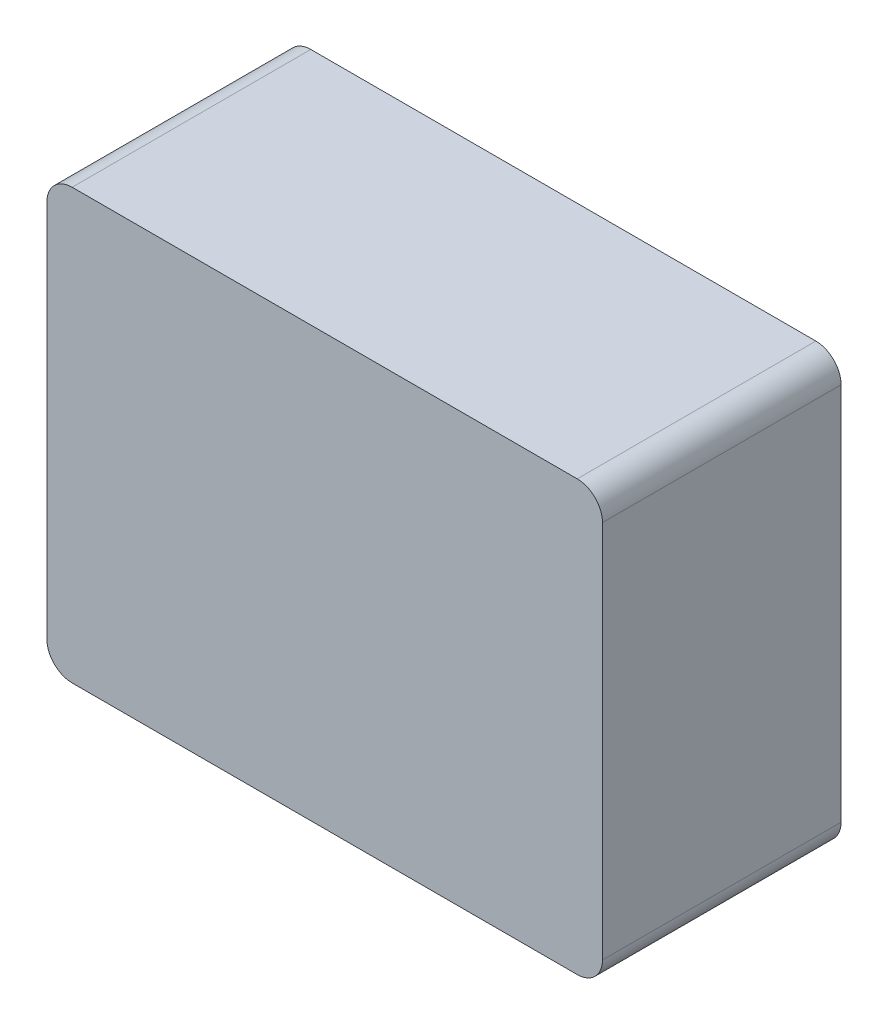
ISO-10303-21;
HEADER;
FILE_DESCRIPTION(('STEP AP214'),'2;1');
FILE_NAME('part.step','',(''),(''),'','','');
FILE_SCHEMA(('AUTOMOTIVE_DESIGN { 1 0 10303 214 1 1 1 1 }'));
ENDSEC;
DATA;
#1=APPLICATION_CONTEXT('core data for automotive mechanical design processes');
#2=APPLICATION_PROTOCOL_DEFINITION('international standard','automotive_design',2000,#1);
#3=PRODUCT_CONTEXT('',#1,'mechanical');
#4=PRODUCT('Part','Part','',(#3));
#5=PRODUCT_RELATED_PRODUCT_CATEGORY('part','',(#4));
#6=PRODUCT_DEFINITION_FORMATION('','',#4);
#7=PRODUCT_DEFINITION_CONTEXT('part definition',#1,'design');
#8=PRODUCT_DEFINITION('design','',#6,#7);
#9=PRODUCT_DEFINITION_SHAPE('','',#8);
#10=(LENGTH_UNIT() NAMED_UNIT(*) SI_UNIT(.MILLI.,.METRE.));
#11=(NAMED_UNIT(*) PLANE_ANGLE_UNIT() SI_UNIT($,.RADIAN.));
#12=(NAMED_UNIT(*) SI_UNIT($,.STERADIAN.) SOLID_ANGLE_UNIT());
#13=UNCERTAINTY_MEASURE_WITH_UNIT(LENGTH_MEASURE(1.E-05),#10,'distance_accuracy_value','');
#14=(GEOMETRIC_REPRESENTATION_CONTEXT(3) GLOBAL_UNCERTAINTY_ASSIGNED_CONTEXT((#13)) GLOBAL_UNIT_ASSIGNED_CONTEXT((#10,
#11,#12)) REPRESENTATION_CONTEXT('',''));
#15=CARTESIAN_POINT('',(0.,0.,0.));
#16=DIRECTION('',(0.,0.,1.));
#17=DIRECTION('',(1.,0.,0.));
#18=AXIS2_PLACEMENT_3D('',#15,#16,#17);
#19=CARTESIAN_POINT('',(0.,34.,0.));
#20=DIRECTION('',(-1.,0.,0.));
#21=DIRECTION('',(0.,0.,1.));
#22=AXIS2_PLACEMENT_3D('',#19,#20,#21);
#23=PLANE('',#22);
#24=DIRECTION('',(0.,-1.,0.));
#25=VECTOR('',#24,1.);
#26=CARTESIAN_POINT('',(0.,34.,-18.9));
#27=LINE('',#26,#25);
#28=CARTESIAN_POINT('',(0.,32.,-18.9));
#29=VERTEX_POINT('',#28);
#30=CARTESIAN_POINT('',(0.,2.,-18.9));
#31=VERTEX_POINT('',#30);
#32=EDGE_CURVE('E144',#29,#31,#27,.T.);
#33=ORIENTED_EDGE('',*,*,#32,.T.);
#34=DIRECTION('',(0.,0.,-1.));
#35=VECTOR('',#34,1.);
#36=CARTESIAN_POINT('',(0.,2.,0.));
#37=LINE('',#36,#35);
#38=CARTESIAN_POINT('',(0.,2.,0.));
#39=VERTEX_POINT('',#38);
#40=EDGE_CURVE('E104',#31,#39,#37,.F.);
#41=ORIENTED_EDGE('',*,*,#40,.T.);
#42=DIRECTION('',(0.,-1.,0.));
#43=VECTOR('',#42,1.);
#44=CARTESIAN_POINT('',(0.,34.,0.));
#45=LINE('',#44,#43);
#46=CARTESIAN_POINT('',(0.,32.,0.));
#47=VERTEX_POINT('',#46);
#48=EDGE_CURVE('E136',#47,#39,#45,.T.);
#49=ORIENTED_EDGE('',*,*,#48,.F.);
#50=DIRECTION('',(0.,0.,-1.));
#51=VECTOR('',#50,1.);
#52=CARTESIAN_POINT('',(0.,32.,-18.9));
#53=LINE('',#52,#51);
#54=EDGE_CURVE('E109',#47,#29,#53,.T.);
#55=ORIENTED_EDGE('',*,*,#54,.T.);
#56=EDGE_LOOP('',(#33,#41,#49,#55));
#57=FACE_BOUND('',#56,.T.);
#58=ADVANCED_FACE('F33',(#57),#23,.T.);
#59=CARTESIAN_POINT('',(0.,34.,0.));
#60=DIRECTION('',(0.,0.,-1.));
#61=DIRECTION('',(-1.,0.,0.));
#62=AXIS2_PLACEMENT_3D('',#59,#60,#61);
#63=PLANE('',#62);
#64=ORIENTED_EDGE('',*,*,#48,.T.);
#65=CARTESIAN_POINT('',(2.,2.,0.));
#66=DIRECTION('',(0.,0.,-1.));
#67=DIRECTION('',(-1.,0.,0.));
#68=AXIS2_PLACEMENT_3D('',#65,#66,#67);
#69=CIRCLE('',#68,2.);
#70=CARTESIAN_POINT('',(2.,0.,0.));
#71=VERTEX_POINT('',#70);
#72=EDGE_CURVE('E159',#39,#71,#69,.F.);
#73=ORIENTED_EDGE('',*,*,#72,.T.);
#74=DIRECTION('',(1.,0.,0.));
#75=VECTOR('',#74,1.);
#76=CARTESIAN_POINT('',(0.,0.,0.));
#77=LINE('',#76,#75);
#78=CARTESIAN_POINT('',(42.,0.,0.));
#79=VERTEX_POINT('',#78);
#80=EDGE_CURVE('E119',#71,#79,#77,.T.);
#81=ORIENTED_EDGE('',*,*,#80,.T.);
#82=CARTESIAN_POINT('',(42.,2.,0.));
#83=DIRECTION('',(0.,0.,-1.));
#84=DIRECTION('',(-1.,0.,0.));
#85=AXIS2_PLACEMENT_3D('',#82,#83,#84);
#86=CIRCLE('',#85,2.);
#87=CARTESIAN_POINT('',(44.,2.,0.));
#88=VERTEX_POINT('',#87);
#89=EDGE_CURVE('E157',#79,#88,#86,.F.);
#90=ORIENTED_EDGE('',*,*,#89,.T.);
#91=DIRECTION('',(0.,-1.,0.));
#92=VECTOR('',#91,1.);
#93=CARTESIAN_POINT('',(44.,34.,0.));
#94=LINE('',#93,#92);
#95=CARTESIAN_POINT('',(44.,32.,0.));
#96=VERTEX_POINT('',#95);
#97=EDGE_CURVE('E139',#96,#88,#94,.T.);
#98=ORIENTED_EDGE('',*,*,#97,.F.);
#99=CARTESIAN_POINT('',(42.,32.,0.));
#100=DIRECTION('',(0.,0.,-1.));
#101=DIRECTION('',(-1.,0.,0.));
#102=AXIS2_PLACEMENT_3D('',#99,#100,#101);
#103=CIRCLE('',#102,2.);
#104=CARTESIAN_POINT('',(42.,34.,0.));
#105=VERTEX_POINT('',#104);
#106=EDGE_CURVE('E48',#96,#105,#103,.F.);
#107=ORIENTED_EDGE('',*,*,#106,.T.);
#108=DIRECTION('',(1.,0.,0.));
#109=VECTOR('',#108,1.);
#110=CARTESIAN_POINT('',(0.,34.,0.));
#111=LINE('',#110,#109);
#112=CARTESIAN_POINT('',(2.,34.,0.));
#113=VERTEX_POINT('',#112);
#114=EDGE_CURVE('E133',#113,#105,#111,.T.);
#115=ORIENTED_EDGE('',*,*,#114,.F.);
#116=CARTESIAN_POINT('',(2.,32.,0.));
#117=DIRECTION('',(0.,0.,-1.));
#118=DIRECTION('',(-1.,0.,0.));
#119=AXIS2_PLACEMENT_3D('',#116,#117,#118);
#120=CIRCLE('',#119,2.);
#121=EDGE_CURVE('E154',#113,#47,#120,.F.);
#122=ORIENTED_EDGE('',*,*,#121,.T.);
#123=EDGE_LOOP('',(#64,#73,#81,#90,#98,#107,#115,#122));
#124=FACE_BOUND('',#123,.T.);
#125=ADVANCED_FACE('F234',(#124),#63,.F.);
#126=CARTESIAN_POINT('',(44.,34.,0.));
#127=DIRECTION('',(-1.,0.,0.));
#128=DIRECTION('',(0.,0.,1.));
#129=AXIS2_PLACEMENT_3D('',#126,#127,#128);
#130=PLANE('',#129);
#131=ORIENTED_EDGE('',*,*,#97,.T.);
#132=DIRECTION('',(0.,0.,-1.));
#133=VECTOR('',#132,1.);
#134=CARTESIAN_POINT('',(44.,2.,-18.9));
#135=LINE('',#134,#133);
#136=CARTESIAN_POINT('',(44.,2.,-18.9));
#137=VERTEX_POINT('',#136);
#138=EDGE_CURVE('E163',#88,#137,#135,.T.);
#139=ORIENTED_EDGE('',*,*,#138,.T.);
#140=DIRECTION('',(0.,-1.,0.));
#141=VECTOR('',#140,1.);
#142=CARTESIAN_POINT('',(44.,34.,-18.9));
#143=LINE('',#142,#141);
#144=CARTESIAN_POINT('',(44.,32.,-18.9));
#145=VERTEX_POINT('',#144);
#146=EDGE_CURVE('E142',#145,#137,#143,.T.);
#147=ORIENTED_EDGE('',*,*,#146,.F.);
#148=DIRECTION('',(0.,0.,-1.));
#149=VECTOR('',#148,1.);
#150=CARTESIAN_POINT('',(44.,32.,0.));
#151=LINE('',#150,#149);
#152=EDGE_CURVE('E161',#145,#96,#151,.F.);
#153=ORIENTED_EDGE('',*,*,#152,.T.);
#154=EDGE_LOOP('',(#131,#139,#147,#153));
#155=FACE_BOUND('',#154,.T.);
#156=ADVANCED_FACE('F168',(#155),#130,.F.);
#157=CARTESIAN_POINT('',(0.,34.,-18.9));
#158=DIRECTION('',(0.,0.,-1.));
#159=DIRECTION('',(-1.,0.,0.));
#160=AXIS2_PLACEMENT_3D('',#157,#158,#159);
#161=PLANE('',#160);
#162=DIRECTION('',(1.,0.,0.));
#163=VECTOR('',#162,1.);
#164=CARTESIAN_POINT('',(0.,0.,-18.9));
#165=LINE('',#164,#163);
#166=CARTESIAN_POINT('',(2.,0.,-18.9));
#167=VERTEX_POINT('',#166);
#168=CARTESIAN_POINT('',(42.,0.,-18.9));
#169=VERTEX_POINT('',#168);
#170=EDGE_CURVE('E116',#167,#169,#165,.T.);
#171=ORIENTED_EDGE('',*,*,#170,.F.);
#172=CARTESIAN_POINT('',(2.,2.,-18.9));
#173=DIRECTION('',(0.,0.,-1.));
#174=DIRECTION('',(-1.,0.,0.));
#175=AXIS2_PLACEMENT_3D('',#172,#173,#174);
#176=CIRCLE('',#175,2.);
#177=EDGE_CURVE('E99',#167,#31,#176,.T.);
#178=ORIENTED_EDGE('',*,*,#177,.T.);
#179=ORIENTED_EDGE('',*,*,#32,.F.);
#180=CARTESIAN_POINT('',(2.,32.,-18.9));
#181=DIRECTION('',(0.,0.,-1.));
#182=DIRECTION('',(-1.,0.,0.));
#183=AXIS2_PLACEMENT_3D('',#180,#181,#182);
#184=CIRCLE('',#183,2.);
#185=CARTESIAN_POINT('',(2.,34.,-18.9));
#186=VERTEX_POINT('',#185);
#187=EDGE_CURVE('E120',#29,#186,#184,.T.);
#188=ORIENTED_EDGE('',*,*,#187,.T.);
#189=DIRECTION('',(1.,0.,0.));
#190=VECTOR('',#189,1.);
#191=CARTESIAN_POINT('',(0.,34.,-18.9));
#192=LINE('',#191,#190);
#193=CARTESIAN_POINT('',(42.,34.,-18.9));
#194=VERTEX_POINT('',#193);
#195=EDGE_CURVE('E127',#186,#194,#192,.T.);
#196=ORIENTED_EDGE('',*,*,#195,.T.);
#197=CARTESIAN_POINT('',(42.,32.,-18.9));
#198=DIRECTION('',(0.,0.,-1.));
#199=DIRECTION('',(-1.,0.,0.));
#200=AXIS2_PLACEMENT_3D('',#197,#198,#199);
#201=CIRCLE('',#200,2.);
#202=EDGE_CURVE('E148',#194,#145,#201,.T.);
#203=ORIENTED_EDGE('',*,*,#202,.T.);
#204=ORIENTED_EDGE('',*,*,#146,.T.);
#205=CARTESIAN_POINT('',(42.,2.,-18.9));
#206=DIRECTION('',(0.,0.,-1.));
#207=DIRECTION('',(-1.,0.,0.));
#208=AXIS2_PLACEMENT_3D('',#205,#206,#207);
#209=CIRCLE('',#208,2.);
#210=EDGE_CURVE('E110',#137,#169,#209,.T.);
#211=ORIENTED_EDGE('',*,*,#210,.T.);
#212=EDGE_LOOP('',(#171,#178,#179,#188,#196,#203,#204,#211));
#213=FACE_BOUND('',#212,.T.);
#214=ADVANCED_FACE('F123',(#213),#161,.T.);
#215=CARTESIAN_POINT('',(0.,34.,0.));
#216=DIRECTION('',(0.,-1.,0.));
#217=DIRECTION('',(0.,0.,-1.));
#218=AXIS2_PLACEMENT_3D('',#215,#216,#217);
#219=PLANE('',#218);
#220=ORIENTED_EDGE('',*,*,#114,.T.);
#221=DIRECTION('',(0.,0.,-1.));
#222=VECTOR('',#221,1.);
#223=CARTESIAN_POINT('',(42.,34.,0.));
#224=LINE('',#223,#222);
#225=EDGE_CURVE('E11',#105,#194,#224,.T.);
#226=ORIENTED_EDGE('',*,*,#225,.T.);
#227=ORIENTED_EDGE('',*,*,#195,.F.);
#228=DIRECTION('',(0.,0.,-1.));
#229=VECTOR('',#228,1.);
#230=CARTESIAN_POINT('',(2.,34.,0.));
#231=LINE('',#230,#229);
#232=EDGE_CURVE('E41',#186,#113,#231,.F.);
#233=ORIENTED_EDGE('',*,*,#232,.T.);
#234=EDGE_LOOP('',(#220,#226,#227,#233));
#235=FACE_BOUND('',#234,.T.);
#236=ADVANCED_FACE('F176',(#235),#219,.F.);
#237=CARTESIAN_POINT('',(0.,0.,0.));
#238=DIRECTION('',(0.,-1.,0.));
#239=DIRECTION('',(0.,0.,-1.));
#240=AXIS2_PLACEMENT_3D('',#237,#238,#239);
#241=PLANE('',#240);
#242=CARTESIAN_POINT('',(33.,0.,-15.02));
#243=DIRECTION('',(0.,-1.,0.));
#244=DIRECTION('',(0.,0.,-1.));
#245=AXIS2_PLACEMENT_3D('',#242,#243,#244);
#246=CIRCLE('',#245,0.999999999999998);
#247=CARTESIAN_POINT('',(33.,0.,-16.02));
#248=VERTEX_POINT('',#247);
#249=EDGE_CURVE('E194',#248,#248,#246,.T.);
#250=ORIENTED_EDGE('',*,*,#249,.F.);
#251=EDGE_LOOP('',(#250));
#252=FACE_BOUND('',#251,.T.);
#253=CARTESIAN_POINT('',(11.,0.,-15.02));
#254=DIRECTION('',(0.,-1.,0.));
#255=DIRECTION('',(0.,0.,-1.));
#256=AXIS2_PLACEMENT_3D('',#253,#254,#255);
#257=CIRCLE('',#256,1.);
#258=CARTESIAN_POINT('',(11.,0.,-16.02));
#259=VERTEX_POINT('',#258);
#260=EDGE_CURVE('E188',#259,#259,#257,.T.);
#261=ORIENTED_EDGE('',*,*,#260,.F.);
#262=EDGE_LOOP('',(#261));
#263=FACE_BOUND('',#262,.T.);
#264=CARTESIAN_POINT('',(33.,0.,-3.02000000000002));
#265=DIRECTION('',(0.,-1.,0.));
#266=DIRECTION('',(0.,0.,-1.));
#267=AXIS2_PLACEMENT_3D('',#264,#265,#266);
#268=CIRCLE('',#267,0.999999999999998);
#269=CARTESIAN_POINT('',(33.,0.,-4.02000000000002));
#270=VERTEX_POINT('',#269);
#271=EDGE_CURVE('E182',#270,#270,#268,.T.);
#272=ORIENTED_EDGE('',*,*,#271,.F.);
#273=EDGE_LOOP('',(#272));
#274=FACE_BOUND('',#273,.T.);
#275=CARTESIAN_POINT('',(11.,0.,-3.02000000000003));
#276=DIRECTION('',(0.,-1.,0.));
#277=DIRECTION('',(0.,0.,-1.));
#278=AXIS2_PLACEMENT_3D('',#275,#276,#277);
#279=CIRCLE('',#278,1.);
#280=CARTESIAN_POINT('',(11.,0.,-4.02000000000003));
#281=VERTEX_POINT('',#280);
#282=EDGE_CURVE('E130',#281,#281,#279,.T.);
#283=ORIENTED_EDGE('',*,*,#282,.F.);
#284=EDGE_LOOP('',(#283));
#285=FACE_BOUND('',#284,.T.);
#286=ORIENTED_EDGE('',*,*,#80,.F.);
#287=DIRECTION('',(0.,0.,-1.));
#288=VECTOR('',#287,1.);
#289=CARTESIAN_POINT('',(2.,0.,0.));
#290=LINE('',#289,#288);
#291=EDGE_CURVE('E103',#71,#167,#290,.T.);
#292=ORIENTED_EDGE('',*,*,#291,.T.);
#293=ORIENTED_EDGE('',*,*,#170,.T.);
#294=DIRECTION('',(0.,0.,-1.));
#295=VECTOR('',#294,1.);
#296=CARTESIAN_POINT('',(42.,0.,0.));
#297=LINE('',#296,#295);
#298=EDGE_CURVE('E121',#169,#79,#297,.F.);
#299=ORIENTED_EDGE('',*,*,#298,.T.);
#300=EDGE_LOOP('',(#286,#292,#293,#299));
#301=FACE_BOUND('',#300,.T.);
#302=ADVANCED_FACE('F115',(#252,#263,#274,#285,#301),#241,.T.);
#303=CARTESIAN_POINT('',(2.,2.,0.));
#304=DIRECTION('',(0.,0.,-1.));
#305=DIRECTION('',(-1.,0.,0.));
#306=AXIS2_PLACEMENT_3D('',#303,#304,#305);
#307=CYLINDRICAL_SURFACE('',#306,2.);
#308=ORIENTED_EDGE('',*,*,#72,.F.);
#309=ORIENTED_EDGE('',*,*,#40,.F.);
#310=ORIENTED_EDGE('',*,*,#177,.F.);
#311=ORIENTED_EDGE('',*,*,#291,.F.);
#312=EDGE_LOOP('',(#308,#309,#310,#311));
#313=FACE_BOUND('',#312,.T.);
#314=ADVANCED_FACE('F102',(#313),#307,.T.);
#315=CARTESIAN_POINT('',(42.,2.,0.));
#316=DIRECTION('',(0.,0.,1.));
#317=DIRECTION('',(1.,0.,0.));
#318=AXIS2_PLACEMENT_3D('',#315,#316,#317);
#319=CYLINDRICAL_SURFACE('',#318,2.);
#320=ORIENTED_EDGE('',*,*,#89,.F.);
#321=ORIENTED_EDGE('',*,*,#298,.F.);
#322=ORIENTED_EDGE('',*,*,#210,.F.);
#323=ORIENTED_EDGE('',*,*,#138,.F.);
#324=EDGE_LOOP('',(#320,#321,#322,#323));
#325=FACE_BOUND('',#324,.T.);
#326=ADVANCED_FACE('F246',(#325),#319,.T.);
#327=CARTESIAN_POINT('',(42.,32.,0.));
#328=DIRECTION('',(0.,0.,-1.));
#329=DIRECTION('',(-1.,0.,0.));
#330=AXIS2_PLACEMENT_3D('',#327,#328,#329);
#331=CYLINDRICAL_SURFACE('',#330,2.);
#332=ORIENTED_EDGE('',*,*,#106,.F.);
#333=ORIENTED_EDGE('',*,*,#152,.F.);
#334=ORIENTED_EDGE('',*,*,#202,.F.);
#335=ORIENTED_EDGE('',*,*,#225,.F.);
#336=EDGE_LOOP('',(#332,#333,#334,#335));
#337=FACE_BOUND('',#336,.T.);
#338=ADVANCED_FACE('F175',(#337),#331,.T.);
#339=CARTESIAN_POINT('',(2.,32.,0.));
#340=DIRECTION('',(0.,0.,1.));
#341=DIRECTION('',(1.,0.,0.));
#342=AXIS2_PLACEMENT_3D('',#339,#340,#341);
#343=CYLINDRICAL_SURFACE('',#342,2.);
#344=ORIENTED_EDGE('',*,*,#121,.F.);
#345=ORIENTED_EDGE('',*,*,#232,.F.);
#346=ORIENTED_EDGE('',*,*,#187,.F.);
#347=ORIENTED_EDGE('',*,*,#54,.F.);
#348=EDGE_LOOP('',(#344,#345,#346,#347));
#349=FACE_BOUND('',#348,.T.);
#350=ADVANCED_FACE('F35',(#349),#343,.T.);
#351=CARTESIAN_POINT('',(11.,3.5,-3.02000000000003));
#352=DIRECTION('',(0.,-1.,0.));
#353=DIRECTION('',(0.,0.,-1.));
#354=AXIS2_PLACEMENT_3D('',#351,#352,#353);
#355=CYLINDRICAL_SURFACE('',#354,1.);
#356=CARTESIAN_POINT('',(11.,3.5,-3.02000000000003));
#357=DIRECTION('',(0.,-1.,0.));
#358=DIRECTION('',(0.,0.,-1.));
#359=AXIS2_PLACEMENT_3D('',#356,#357,#358);
#360=CIRCLE('',#359,1.);
#361=CARTESIAN_POINT('',(11.,3.5,-4.02000000000003));
#362=VERTEX_POINT('',#361);
#363=EDGE_CURVE('E125',#362,#362,#360,.T.);
#364=ORIENTED_EDGE('',*,*,#363,.F.);
#365=EDGE_LOOP('',(#364));
#366=FACE_BOUND('',#365,.T.);
#367=ORIENTED_EDGE('',*,*,#282,.T.);
#368=EDGE_LOOP('',(#367));
#369=FACE_BOUND('',#368,.T.);
#370=ADVANCED_FACE('F218',(#366,#369),#355,.F.);
#371=CARTESIAN_POINT('',(11.,3.5,-3.02000000000003));
#372=DIRECTION('',(0.,-1.,0.));
#373=DIRECTION('',(0.,0.,-1.));
#374=AXIS2_PLACEMENT_3D('',#371,#372,#373);
#375=PLANE('',#374);
#376=ORIENTED_EDGE('',*,*,#363,.T.);
#377=EDGE_LOOP('',(#376));
#378=FACE_BOUND('',#377,.T.);
#379=ADVANCED_FACE('F220',(#378),#375,.T.);
#380=CARTESIAN_POINT('',(33.,3.5,-3.02000000000002));
#381=DIRECTION('',(0.,-1.,0.));
#382=DIRECTION('',(0.,0.,-1.));
#383=AXIS2_PLACEMENT_3D('',#380,#381,#382);
#384=CYLINDRICAL_SURFACE('',#383,0.999999999999998);
#385=CARTESIAN_POINT('',(33.,3.5,-3.02000000000002));
#386=DIRECTION('',(0.,-1.,0.));
#387=DIRECTION('',(0.,0.,-1.));
#388=AXIS2_PLACEMENT_3D('',#385,#386,#387);
#389=CIRCLE('',#388,0.999999999999998);
#390=CARTESIAN_POINT('',(33.,3.5,-4.02000000000002));
#391=VERTEX_POINT('',#390);
#392=EDGE_CURVE('E180',#391,#391,#389,.T.);
#393=ORIENTED_EDGE('',*,*,#392,.F.);
#394=EDGE_LOOP('',(#393));
#395=FACE_BOUND('',#394,.T.);
#396=ORIENTED_EDGE('',*,*,#271,.T.);
#397=EDGE_LOOP('',(#396));
#398=FACE_BOUND('',#397,.T.);
#399=ADVANCED_FACE('F227',(#395,#398),#384,.F.);
#400=CARTESIAN_POINT('',(33.,3.5,-3.02000000000002));
#401=DIRECTION('',(0.,-1.,0.));
#402=DIRECTION('',(0.,0.,-1.));
#403=AXIS2_PLACEMENT_3D('',#400,#401,#402);
#404=PLANE('',#403);
#405=ORIENTED_EDGE('',*,*,#392,.T.);
#406=EDGE_LOOP('',(#405));
#407=FACE_BOUND('',#406,.T.);
#408=ADVANCED_FACE('F285',(#407),#404,.T.);
#409=CARTESIAN_POINT('',(11.,3.5,-15.02));
#410=DIRECTION('',(0.,-1.,0.));
#411=DIRECTION('',(0.,0.,-1.));
#412=AXIS2_PLACEMENT_3D('',#409,#410,#411);
#413=CYLINDRICAL_SURFACE('',#412,1.);
#414=CARTESIAN_POINT('',(11.,3.5,-15.02));
#415=DIRECTION('',(0.,-1.,0.));
#416=DIRECTION('',(0.,0.,-1.));
#417=AXIS2_PLACEMENT_3D('',#414,#415,#416);
#418=CIRCLE('',#417,1.);
#419=CARTESIAN_POINT('',(11.,3.5,-16.02));
#420=VERTEX_POINT('',#419);
#421=EDGE_CURVE('E185',#420,#420,#418,.T.);
#422=ORIENTED_EDGE('',*,*,#421,.F.);
#423=EDGE_LOOP('',(#422));
#424=FACE_BOUND('',#423,.T.);
#425=ORIENTED_EDGE('',*,*,#260,.T.);
#426=EDGE_LOOP('',(#425));
#427=FACE_BOUND('',#426,.T.);
#428=ADVANCED_FACE('F295',(#424,#427),#413,.F.);
#429=CARTESIAN_POINT('',(11.,3.5,-15.02));
#430=DIRECTION('',(0.,-1.,0.));
#431=DIRECTION('',(0.,0.,-1.));
#432=AXIS2_PLACEMENT_3D('',#429,#430,#431);
#433=PLANE('',#432);
#434=ORIENTED_EDGE('',*,*,#421,.T.);
#435=EDGE_LOOP('',(#434));
#436=FACE_BOUND('',#435,.T.);
#437=ADVANCED_FACE('F205',(#436),#433,.T.);
#438=CARTESIAN_POINT('',(33.,3.5,-15.02));
#439=DIRECTION('',(0.,-1.,0.));
#440=DIRECTION('',(0.,0.,-1.));
#441=AXIS2_PLACEMENT_3D('',#438,#439,#440);
#442=CYLINDRICAL_SURFACE('',#441,0.999999999999998);
#443=CARTESIAN_POINT('',(33.,3.5,-15.02));
#444=DIRECTION('',(0.,-1.,0.));
#445=DIRECTION('',(0.,0.,-1.));
#446=AXIS2_PLACEMENT_3D('',#443,#444,#445);
#447=CIRCLE('',#446,0.999999999999998);
#448=CARTESIAN_POINT('',(33.,3.5,-16.02));
#449=VERTEX_POINT('',#448);
#450=EDGE_CURVE('E191',#449,#449,#447,.T.);
#451=ORIENTED_EDGE('',*,*,#450,.F.);
#452=EDGE_LOOP('',(#451));
#453=FACE_BOUND('',#452,.T.);
#454=ORIENTED_EDGE('',*,*,#249,.T.);
#455=EDGE_LOOP('',(#454));
#456=FACE_BOUND('',#455,.T.);
#457=ADVANCED_FACE('F202',(#453,#456),#442,.F.);
#458=CARTESIAN_POINT('',(33.,3.5,-15.02));
#459=DIRECTION('',(0.,-1.,0.));
#460=DIRECTION('',(0.,0.,-1.));
#461=AXIS2_PLACEMENT_3D('',#458,#459,#460);
#462=PLANE('',#461);
#463=ORIENTED_EDGE('',*,*,#450,.T.);
#464=EDGE_LOOP('',(#463));
#465=FACE_BOUND('',#464,.T.);
#466=ADVANCED_FACE('F200',(#465),#462,.T.);
#467=CLOSED_SHELL('',(#58,#125,#156,#214,#236,#302,#314,#326,#338,#350,#370,#379,#399,#408,#428,
#437,#457,#466));
#468=MANIFOLD_SOLID_BREP('B2',#467);
#469=ADVANCED_BREP_SHAPE_REPRESENTATION('',(#18,#468),#14);
#470=SHAPE_DEFINITION_REPRESENTATION(#9,#469);
ENDSEC;
END-ISO-10303-21;
